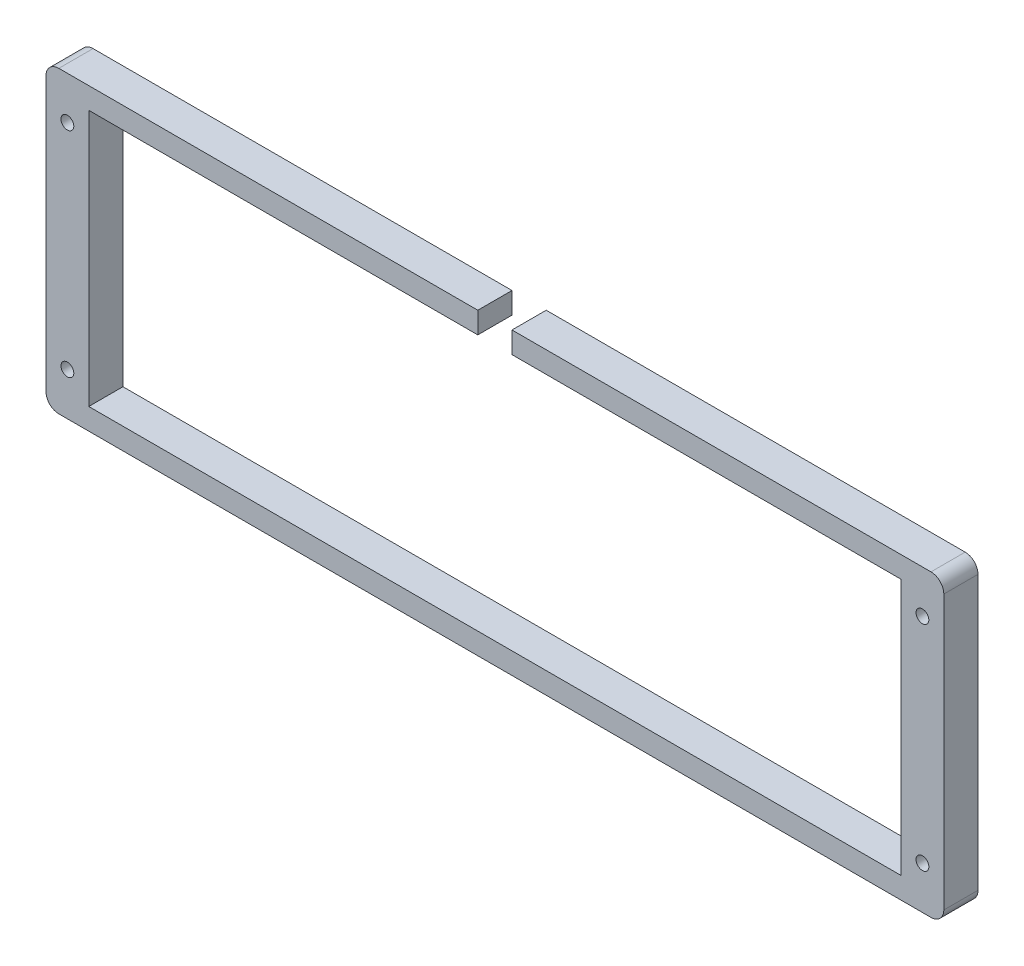
ISO-10303-21;
HEADER;
FILE_DESCRIPTION(('STEP AP214'),'2;1');
FILE_NAME('part.step','',(''),(''),'','','');
FILE_SCHEMA(('AUTOMOTIVE_DESIGN { 1 0 10303 214 1 1 1 1 }'));
ENDSEC;
DATA;
#1=APPLICATION_CONTEXT('core data for automotive mechanical design processes');
#2=APPLICATION_PROTOCOL_DEFINITION('international standard','automotive_design',2000,#1);
#3=PRODUCT_CONTEXT('',#1,'mechanical');
#4=PRODUCT('Part','Part','',(#3));
#5=PRODUCT_RELATED_PRODUCT_CATEGORY('part','',(#4));
#6=PRODUCT_DEFINITION_FORMATION('','',#4);
#7=PRODUCT_DEFINITION_CONTEXT('part definition',#1,'design');
#8=PRODUCT_DEFINITION('design','',#6,#7);
#9=PRODUCT_DEFINITION_SHAPE('','',#8);
#10=(LENGTH_UNIT() NAMED_UNIT(*) SI_UNIT(.MILLI.,.METRE.));
#11=(NAMED_UNIT(*) PLANE_ANGLE_UNIT() SI_UNIT($,.RADIAN.));
#12=(NAMED_UNIT(*) SI_UNIT($,.STERADIAN.) SOLID_ANGLE_UNIT());
#13=UNCERTAINTY_MEASURE_WITH_UNIT(LENGTH_MEASURE(1.E-05),#10,'distance_accuracy_value','');
#14=(GEOMETRIC_REPRESENTATION_CONTEXT(3) GLOBAL_UNCERTAINTY_ASSIGNED_CONTEXT((#13)) GLOBAL_UNIT_ASSIGNED_CONTEXT((#10,
#11,#12)) REPRESENTATION_CONTEXT('',''));
#15=CARTESIAN_POINT('',(0.,0.,0.));
#16=DIRECTION('',(0.,0.,1.));
#17=DIRECTION('',(1.,0.,0.));
#18=AXIS2_PLACEMENT_3D('',#15,#16,#17);
#19=CARTESIAN_POINT('',(-30.,46.5,8.));
#20=DIRECTION('',(0.,-1.,0.));
#21=DIRECTION('',(0.,0.,-1.));
#22=AXIS2_PLACEMENT_3D('',#19,#20,#21);
#23=PLANE('',#22);
#24=DIRECTION('',(-1.,0.,0.));
#25=VECTOR('',#24,1.);
#26=CARTESIAN_POINT('',(-30.,46.5,8.));
#27=LINE('',#26,#25);
#28=CARTESIAN_POINT('',(177.,46.5,8.));
#29=VERTEX_POINT('',#28);
#30=CARTESIAN_POINT('',(79.,46.5,8.));
#31=VERTEX_POINT('',#30);
#32=EDGE_CURVE('E211',#29,#31,#27,.T.);
#33=ORIENTED_EDGE('',*,*,#32,.F.);
#34=DIRECTION('',(0.,0.,-1.));
#35=VECTOR('',#34,1.);
#36=CARTESIAN_POINT('',(177.,46.5,8.));
#37=LINE('',#36,#35);
#38=CARTESIAN_POINT('',(177.,46.5,0.));
#39=VERTEX_POINT('',#38);
#40=EDGE_CURVE('E248',#29,#39,#37,.T.);
#41=ORIENTED_EDGE('',*,*,#40,.T.);
#42=DIRECTION('',(-1.,0.,0.));
#43=VECTOR('',#42,1.);
#44=CARTESIAN_POINT('',(-30.,46.5,0.));
#45=LINE('',#44,#43);
#46=CARTESIAN_POINT('',(79.,46.5,0.));
#47=VERTEX_POINT('',#46);
#48=EDGE_CURVE('E205',#39,#47,#45,.T.);
#49=ORIENTED_EDGE('',*,*,#48,.T.);
#50=DIRECTION('',(0.,0.,-1.));
#51=VECTOR('',#50,1.);
#52=CARTESIAN_POINT('',(79.,46.5,10.));
#53=LINE('',#52,#51);
#54=EDGE_CURVE('E285',#31,#47,#53,.T.);
#55=ORIENTED_EDGE('',*,*,#54,.F.);
#56=EDGE_LOOP('',(#33,#41,#49,#55));
#57=FACE_BOUND('',#56,.T.);
#58=ADVANCED_FACE('F33',(#57),#23,.F.);
#59=CARTESIAN_POINT('',(-20.,41.5,10.));
#60=DIRECTION('',(0.,-1.,0.));
#61=DIRECTION('',(0.,0.,-1.));
#62=AXIS2_PLACEMENT_3D('',#59,#60,#61);
#63=PLANE('',#62);
#64=DIRECTION('',(0.,0.,1.));
#65=VECTOR('',#64,1.);
#66=CARTESIAN_POINT('',(79.,41.5,10.));
#67=LINE('',#66,#65);
#68=CARTESIAN_POINT('',(79.,41.5,0.));
#69=VERTEX_POINT('',#68);
#70=CARTESIAN_POINT('',(79.,41.5,8.));
#71=VERTEX_POINT('',#70);
#72=EDGE_CURVE('E213',#69,#71,#67,.T.);
#73=ORIENTED_EDGE('',*,*,#72,.F.);
#74=DIRECTION('',(-1.,0.,0.));
#75=VECTOR('',#74,1.);
#76=CARTESIAN_POINT('',(-20.,41.5,0.));
#77=LINE('',#76,#75);
#78=CARTESIAN_POINT('',(170.,41.5,0.));
#79=VERTEX_POINT('',#78);
#80=EDGE_CURVE('E173',#79,#69,#77,.T.);
#81=ORIENTED_EDGE('',*,*,#80,.F.);
#82=DIRECTION('',(0.,0.,-1.));
#83=VECTOR('',#82,1.);
#84=CARTESIAN_POINT('',(170.,41.5,10.));
#85=LINE('',#84,#83);
#86=CARTESIAN_POINT('',(170.,41.5,8.));
#87=VERTEX_POINT('',#86);
#88=EDGE_CURVE('E183',#87,#79,#85,.T.);
#89=ORIENTED_EDGE('',*,*,#88,.F.);
#90=DIRECTION('',(1.,0.,0.));
#91=VECTOR('',#90,1.);
#92=CARTESIAN_POINT('',(0.,41.5,8.));
#93=LINE('',#92,#91);
#94=EDGE_CURVE('E189',#71,#87,#93,.T.);
#95=ORIENTED_EDGE('',*,*,#94,.F.);
#96=EDGE_LOOP('',(#73,#81,#89,#95));
#97=FACE_BOUND('',#96,.T.);
#98=ADVANCED_FACE('F335',(#97),#63,.T.);
#99=CARTESIAN_POINT('',(0.,0.,8.));
#100=DIRECTION('',(0.,0.,1.));
#101=DIRECTION('',(1.,0.,0.));
#102=AXIS2_PLACEMENT_3D('',#99,#100,#101);
#103=PLANE('',#102);
#104=DIRECTION('',(1.,0.,0.));
#105=VECTOR('',#104,1.);
#106=CARTESIAN_POINT('',(-30.,-23.5,8.));
#107=LINE('',#106,#105);
#108=CARTESIAN_POINT('',(-27.,-23.5,8.));
#109=VERTEX_POINT('',#108);
#110=CARTESIAN_POINT('',(177.,-23.5,8.));
#111=VERTEX_POINT('',#110);
#112=EDGE_CURVE('E204',#109,#111,#107,.T.);
#113=ORIENTED_EDGE('',*,*,#112,.T.);
#114=CARTESIAN_POINT('',(177.,-20.5,8.));
#115=DIRECTION('',(0.,0.,1.));
#116=DIRECTION('',(1.,0.,0.));
#117=AXIS2_PLACEMENT_3D('',#114,#115,#116);
#118=CIRCLE('',#117,3.);
#119=CARTESIAN_POINT('',(180.,-20.5,8.));
#120=VERTEX_POINT('',#119);
#121=EDGE_CURVE('E246',#111,#120,#118,.T.);
#122=ORIENTED_EDGE('',*,*,#121,.T.);
#123=DIRECTION('',(0.,1.,0.));
#124=VECTOR('',#123,1.);
#125=CARTESIAN_POINT('',(180.,46.5,8.));
#126=LINE('',#125,#124);
#127=CARTESIAN_POINT('',(180.,43.5,8.));
#128=VERTEX_POINT('',#127);
#129=EDGE_CURVE('E208',#120,#128,#126,.T.);
#130=ORIENTED_EDGE('',*,*,#129,.T.);
#131=CARTESIAN_POINT('',(177.,43.5,8.));
#132=DIRECTION('',(0.,0.,1.));
#133=DIRECTION('',(1.,0.,0.));
#134=AXIS2_PLACEMENT_3D('',#131,#132,#133);
#135=CIRCLE('',#134,3.);
#136=EDGE_CURVE('E48',#128,#29,#135,.T.);
#137=ORIENTED_EDGE('',*,*,#136,.T.);
#138=ORIENTED_EDGE('',*,*,#32,.T.);
#139=DIRECTION('',(0.,1.,0.));
#140=VECTOR('',#139,1.);
#141=CARTESIAN_POINT('',(79.,0.,8.));
#142=LINE('',#141,#140);
#143=EDGE_CURVE('E288',#71,#31,#142,.T.);
#144=ORIENTED_EDGE('',*,*,#143,.F.);
#145=ORIENTED_EDGE('',*,*,#94,.T.);
#146=DIRECTION('',(0.,-1.,0.));
#147=VECTOR('',#146,1.);
#148=CARTESIAN_POINT('',(170.,0.,8.));
#149=LINE('',#148,#147);
#150=CARTESIAN_POINT('',(170.,-18.5,8.));
#151=VERTEX_POINT('',#150);
#152=EDGE_CURVE('E192',#87,#151,#149,.T.);
#153=ORIENTED_EDGE('',*,*,#152,.T.);
#154=DIRECTION('',(-1.,0.,0.));
#155=VECTOR('',#154,1.);
#156=CARTESIAN_POINT('',(0.,-18.5,8.));
#157=LINE('',#156,#155);
#158=CARTESIAN_POINT('',(-20.,-18.5,8.));
#159=VERTEX_POINT('',#158);
#160=EDGE_CURVE('E195',#151,#159,#157,.T.);
#161=ORIENTED_EDGE('',*,*,#160,.T.);
#162=DIRECTION('',(0.,1.,0.));
#163=VECTOR('',#162,1.);
#164=CARTESIAN_POINT('',(-20.,0.,8.));
#165=LINE('',#164,#163);
#166=CARTESIAN_POINT('',(-20.,41.5,8.));
#167=VERTEX_POINT('',#166);
#168=EDGE_CURVE('E198',#159,#167,#165,.T.);
#169=ORIENTED_EDGE('',*,*,#168,.T.);
#170=CARTESIAN_POINT('',(71.,41.5,8.));
#171=VERTEX_POINT('',#170);
#172=EDGE_CURVE('E190',#167,#171,#93,.T.);
#173=ORIENTED_EDGE('',*,*,#172,.T.);
#174=DIRECTION('',(0.,-1.,0.));
#175=VECTOR('',#174,1.);
#176=CARTESIAN_POINT('',(71.,0.,8.));
#177=LINE('',#176,#175);
#178=CARTESIAN_POINT('',(71.,46.5,8.));
#179=VERTEX_POINT('',#178);
#180=EDGE_CURVE('E152',#179,#171,#177,.T.);
#181=ORIENTED_EDGE('',*,*,#180,.F.);
#182=CARTESIAN_POINT('',(-27.,46.5,8.));
#183=VERTEX_POINT('',#182);
#184=EDGE_CURVE('E210',#179,#183,#27,.T.);
#185=ORIENTED_EDGE('',*,*,#184,.T.);
#186=CARTESIAN_POINT('',(-27.,43.5,8.));
#187=DIRECTION('',(0.,0.,1.));
#188=DIRECTION('',(1.,0.,0.));
#189=AXIS2_PLACEMENT_3D('',#186,#187,#188);
#190=CIRCLE('',#189,3.);
#191=CARTESIAN_POINT('',(-30.,43.5,8.));
#192=VERTEX_POINT('',#191);
#193=EDGE_CURVE('E241',#183,#192,#190,.T.);
#194=ORIENTED_EDGE('',*,*,#193,.T.);
#195=DIRECTION('',(0.,-1.,0.));
#196=VECTOR('',#195,1.);
#197=CARTESIAN_POINT('',(-30.,46.5,8.));
#198=LINE('',#197,#196);
#199=CARTESIAN_POINT('',(-30.,-20.5,8.));
#200=VERTEX_POINT('',#199);
#201=EDGE_CURVE('E202',#192,#200,#198,.T.);
#202=ORIENTED_EDGE('',*,*,#201,.T.);
#203=CARTESIAN_POINT('',(-27.,-20.5,8.));
#204=DIRECTION('',(0.,0.,1.));
#205=DIRECTION('',(1.,0.,0.));
#206=AXIS2_PLACEMENT_3D('',#203,#204,#205);
#207=CIRCLE('',#206,3.);
#208=EDGE_CURVE('E243',#200,#109,#207,.T.);
#209=ORIENTED_EDGE('',*,*,#208,.T.);
#210=EDGE_LOOP('',(#113,#122,#130,#137,#138,#144,#145,#153,#161,#169,#173,#181,#185,#194,#202,#209));
#211=FACE_BOUND('',#210,.T.);
#212=CARTESIAN_POINT('',(175.,36.5,8.));
#213=DIRECTION('',(0.,0.,1.));
#214=DIRECTION('',(1.,0.,0.));
#215=AXIS2_PLACEMENT_3D('',#212,#213,#214);
#216=CIRCLE('',#215,1.5);
#217=CARTESIAN_POINT('',(176.5,36.5,8.));
#218=VERTEX_POINT('',#217);
#219=EDGE_CURVE('E312',#218,#218,#216,.F.);
#220=ORIENTED_EDGE('',*,*,#219,.T.);
#221=EDGE_LOOP('',(#220));
#222=FACE_BOUND('',#221,.T.);
#223=CARTESIAN_POINT('',(-25.,-13.5000000000001,8.));
#224=DIRECTION('',(0.,0.,1.));
#225=DIRECTION('',(1.,0.,0.));
#226=AXIS2_PLACEMENT_3D('',#223,#224,#225);
#227=CIRCLE('',#226,1.5);
#228=CARTESIAN_POINT('',(-23.5,-13.5000000000001,8.));
#229=VERTEX_POINT('',#228);
#230=EDGE_CURVE('E309',#229,#229,#227,.F.);
#231=ORIENTED_EDGE('',*,*,#230,.T.);
#232=EDGE_LOOP('',(#231));
#233=FACE_BOUND('',#232,.T.);
#234=CARTESIAN_POINT('',(175.,-13.5,8.));
#235=DIRECTION('',(0.,0.,1.));
#236=DIRECTION('',(1.,0.,0.));
#237=AXIS2_PLACEMENT_3D('',#234,#235,#236);
#238=CIRCLE('',#237,1.5);
#239=CARTESIAN_POINT('',(176.5,-13.5,8.));
#240=VERTEX_POINT('',#239);
#241=EDGE_CURVE('E304',#240,#240,#238,.F.);
#242=ORIENTED_EDGE('',*,*,#241,.T.);
#243=EDGE_LOOP('',(#242));
#244=FACE_BOUND('',#243,.T.);
#245=CARTESIAN_POINT('',(-25.,36.5,8.));
#246=DIRECTION('',(0.,0.,1.));
#247=DIRECTION('',(1.,0.,0.));
#248=AXIS2_PLACEMENT_3D('',#245,#246,#247);
#249=CIRCLE('',#248,1.5);
#250=CARTESIAN_POINT('',(-23.5,36.5,8.));
#251=VERTEX_POINT('',#250);
#252=EDGE_CURVE('E318',#251,#251,#249,.F.);
#253=ORIENTED_EDGE('',*,*,#252,.T.);
#254=EDGE_LOOP('',(#253));
#255=FACE_BOUND('',#254,.T.);
#256=ADVANCED_FACE('F268',(#211,#222,#233,#244,#255),#103,.T.);
#257=CARTESIAN_POINT('',(0.,0.,0.));
#258=DIRECTION('',(0.,0.,1.));
#259=DIRECTION('',(1.,0.,0.));
#260=AXIS2_PLACEMENT_3D('',#257,#258,#259);
#261=PLANE('',#260);
#262=CARTESIAN_POINT('',(175.,36.5,0.));
#263=DIRECTION('',(0.,0.,1.));
#264=DIRECTION('',(-1.,0.,0.));
#265=AXIS2_PLACEMENT_3D('',#262,#263,#264);
#266=CIRCLE('',#265,1.5);
#267=CARTESIAN_POINT('',(173.5,36.5,0.));
#268=VERTEX_POINT('',#267);
#269=EDGE_CURVE('E301',#268,#268,#266,.T.);
#270=ORIENTED_EDGE('',*,*,#269,.T.);
#271=EDGE_LOOP('',(#270));
#272=FACE_BOUND('',#271,.T.);
#273=CARTESIAN_POINT('',(-25.,-13.5000000000001,0.));
#274=DIRECTION('',(0.,0.,1.));
#275=DIRECTION('',(-1.,0.,0.));
#276=AXIS2_PLACEMENT_3D('',#273,#274,#275);
#277=CIRCLE('',#276,1.5);
#278=CARTESIAN_POINT('',(-26.5,-13.5000000000001,0.));
#279=VERTEX_POINT('',#278);
#280=EDGE_CURVE('E296',#279,#279,#277,.T.);
#281=ORIENTED_EDGE('',*,*,#280,.T.);
#282=EDGE_LOOP('',(#281));
#283=FACE_BOUND('',#282,.T.);
#284=CARTESIAN_POINT('',(175.,-13.5,0.));
#285=DIRECTION('',(0.,0.,1.));
#286=DIRECTION('',(1.,0.,0.));
#287=AXIS2_PLACEMENT_3D('',#284,#285,#286);
#288=CIRCLE('',#287,1.5);
#289=CARTESIAN_POINT('',(176.5,-13.5,0.));
#290=VERTEX_POINT('',#289);
#291=EDGE_CURVE('E293',#290,#290,#288,.T.);
#292=ORIENTED_EDGE('',*,*,#291,.T.);
#293=EDGE_LOOP('',(#292));
#294=FACE_BOUND('',#293,.T.);
#295=CARTESIAN_POINT('',(-25.,36.5,0.));
#296=DIRECTION('',(0.,0.,1.));
#297=DIRECTION('',(1.,0.,0.));
#298=AXIS2_PLACEMENT_3D('',#295,#296,#297);
#299=CIRCLE('',#298,1.5);
#300=CARTESIAN_POINT('',(-23.5,36.5,0.));
#301=VERTEX_POINT('',#300);
#302=EDGE_CURVE('E315',#301,#301,#299,.T.);
#303=ORIENTED_EDGE('',*,*,#302,.T.);
#304=EDGE_LOOP('',(#303));
#305=FACE_BOUND('',#304,.T.);
#306=DIRECTION('',(0.,1.,0.));
#307=VECTOR('',#306,1.);
#308=CARTESIAN_POINT('',(180.,46.5,0.));
#309=LINE('',#308,#307);
#310=CARTESIAN_POINT('',(180.,-20.5,0.));
#311=VERTEX_POINT('',#310);
#312=CARTESIAN_POINT('',(180.,43.5,0.));
#313=VERTEX_POINT('',#312);
#314=EDGE_CURVE('E218',#311,#313,#309,.T.);
#315=ORIENTED_EDGE('',*,*,#314,.F.);
#316=CARTESIAN_POINT('',(177.,-20.5,0.));
#317=DIRECTION('',(0.,0.,1.));
#318=DIRECTION('',(1.,0.,0.));
#319=AXIS2_PLACEMENT_3D('',#316,#317,#318);
#320=CIRCLE('',#319,3.);
#321=CARTESIAN_POINT('',(177.,-23.5,0.));
#322=VERTEX_POINT('',#321);
#323=EDGE_CURVE('E234',#311,#322,#320,.F.);
#324=ORIENTED_EDGE('',*,*,#323,.T.);
#325=DIRECTION('',(1.,0.,0.));
#326=VECTOR('',#325,1.);
#327=CARTESIAN_POINT('',(-30.,-23.5,0.));
#328=LINE('',#327,#326);
#329=CARTESIAN_POINT('',(-27.,-23.5,0.));
#330=VERTEX_POINT('',#329);
#331=EDGE_CURVE('E215',#330,#322,#328,.T.);
#332=ORIENTED_EDGE('',*,*,#331,.F.);
#333=CARTESIAN_POINT('',(-27.,-20.5,0.));
#334=DIRECTION('',(0.,0.,1.));
#335=DIRECTION('',(1.,0.,0.));
#336=AXIS2_PLACEMENT_3D('',#333,#334,#335);
#337=CIRCLE('',#336,3.);
#338=CARTESIAN_POINT('',(-30.,-20.5,0.));
#339=VERTEX_POINT('',#338);
#340=EDGE_CURVE('E230',#330,#339,#337,.F.);
#341=ORIENTED_EDGE('',*,*,#340,.T.);
#342=DIRECTION('',(0.,-1.,0.));
#343=VECTOR('',#342,1.);
#344=CARTESIAN_POINT('',(-30.,46.5,0.));
#345=LINE('',#344,#343);
#346=CARTESIAN_POINT('',(-30.,43.5,0.));
#347=VERTEX_POINT('',#346);
#348=EDGE_CURVE('E201',#347,#339,#345,.T.);
#349=ORIENTED_EDGE('',*,*,#348,.F.);
#350=CARTESIAN_POINT('',(-27.,43.5,0.));
#351=DIRECTION('',(0.,0.,1.));
#352=DIRECTION('',(1.,0.,0.));
#353=AXIS2_PLACEMENT_3D('',#350,#351,#352);
#354=CIRCLE('',#353,3.);
#355=CARTESIAN_POINT('',(-27.,46.5,0.));
#356=VERTEX_POINT('',#355);
#357=EDGE_CURVE('E228',#347,#356,#354,.F.);
#358=ORIENTED_EDGE('',*,*,#357,.T.);
#359=CARTESIAN_POINT('',(71.,46.5,0.));
#360=VERTEX_POINT('',#359);
#361=EDGE_CURVE('E167',#360,#356,#45,.T.);
#362=ORIENTED_EDGE('',*,*,#361,.F.);
#363=DIRECTION('',(0.,1.,0.));
#364=VECTOR('',#363,1.);
#365=CARTESIAN_POINT('',(71.,41.5,0.));
#366=LINE('',#365,#364);
#367=CARTESIAN_POINT('',(71.,41.5,0.));
#368=VERTEX_POINT('',#367);
#369=EDGE_CURVE('E149',#368,#360,#366,.T.);
#370=ORIENTED_EDGE('',*,*,#369,.F.);
#371=CARTESIAN_POINT('',(-20.,41.5,0.));
#372=VERTEX_POINT('',#371);
#373=EDGE_CURVE('E164',#368,#372,#77,.T.);
#374=ORIENTED_EDGE('',*,*,#373,.T.);
#375=DIRECTION('',(0.,-1.,0.));
#376=VECTOR('',#375,1.);
#377=CARTESIAN_POINT('',(-20.,41.5,0.));
#378=LINE('',#377,#376);
#379=CARTESIAN_POINT('',(-20.,-18.5,0.));
#380=VERTEX_POINT('',#379);
#381=EDGE_CURVE('E321',#372,#380,#378,.T.);
#382=ORIENTED_EDGE('',*,*,#381,.T.);
#383=DIRECTION('',(1.,0.,0.));
#384=VECTOR('',#383,1.);
#385=CARTESIAN_POINT('',(-20.,-18.5,0.));
#386=LINE('',#385,#384);
#387=CARTESIAN_POINT('',(170.,-18.5,0.));
#388=VERTEX_POINT('',#387);
#389=EDGE_CURVE('E178',#380,#388,#386,.T.);
#390=ORIENTED_EDGE('',*,*,#389,.T.);
#391=DIRECTION('',(0.,1.,0.));
#392=VECTOR('',#391,1.);
#393=CARTESIAN_POINT('',(170.,41.5,0.));
#394=LINE('',#393,#392);
#395=EDGE_CURVE('E174',#388,#79,#394,.T.);
#396=ORIENTED_EDGE('',*,*,#395,.T.);
#397=ORIENTED_EDGE('',*,*,#80,.T.);
#398=DIRECTION('',(0.,1.,0.));
#399=VECTOR('',#398,1.);
#400=CARTESIAN_POINT('',(79.,41.5,0.));
#401=LINE('',#400,#399);
#402=EDGE_CURVE('E156',#69,#47,#401,.T.);
#403=ORIENTED_EDGE('',*,*,#402,.T.);
#404=ORIENTED_EDGE('',*,*,#48,.F.);
#405=CARTESIAN_POINT('',(177.,43.5,0.));
#406=DIRECTION('',(0.,0.,1.));
#407=DIRECTION('',(1.,0.,0.));
#408=AXIS2_PLACEMENT_3D('',#405,#406,#407);
#409=CIRCLE('',#408,3.);
#410=EDGE_CURVE('E232',#39,#313,#409,.F.);
#411=ORIENTED_EDGE('',*,*,#410,.T.);
#412=EDGE_LOOP('',(#315,#324,#332,#341,#349,#358,#362,#370,#374,#382,#390,#396,#397,#403,#404,#411));
#413=FACE_BOUND('',#412,.T.);
#414=ADVANCED_FACE('F162',(#272,#283,#294,#305,#413),#261,.F.);
#415=CARTESIAN_POINT('',(-30.,46.5,8.));
#416=DIRECTION('',(1.,0.,0.));
#417=DIRECTION('',(0.,0.,-1.));
#418=AXIS2_PLACEMENT_3D('',#415,#416,#417);
#419=PLANE('',#418);
#420=ORIENTED_EDGE('',*,*,#348,.T.);
#421=DIRECTION('',(0.,0.,-1.));
#422=VECTOR('',#421,1.);
#423=CARTESIAN_POINT('',(-30.,-20.5,8.));
#424=LINE('',#423,#422);
#425=EDGE_CURVE('E41',#339,#200,#424,.F.);
#426=ORIENTED_EDGE('',*,*,#425,.T.);
#427=ORIENTED_EDGE('',*,*,#201,.F.);
#428=DIRECTION('',(0.,0.,-1.));
#429=VECTOR('',#428,1.);
#430=CARTESIAN_POINT('',(-30.,43.5,8.));
#431=LINE('',#430,#429);
#432=EDGE_CURVE('E251',#192,#347,#431,.T.);
#433=ORIENTED_EDGE('',*,*,#432,.T.);
#434=EDGE_LOOP('',(#420,#426,#427,#433));
#435=FACE_BOUND('',#434,.T.);
#436=ADVANCED_FACE('F255',(#435),#419,.F.);
#437=CARTESIAN_POINT('',(-30.,-23.5,8.));
#438=DIRECTION('',(0.,1.,0.));
#439=DIRECTION('',(0.,0.,1.));
#440=AXIS2_PLACEMENT_3D('',#437,#438,#439);
#441=PLANE('',#440);
#442=ORIENTED_EDGE('',*,*,#331,.T.);
#443=DIRECTION('',(0.,0.,-1.));
#444=VECTOR('',#443,1.);
#445=CARTESIAN_POINT('',(177.,-23.5,8.));
#446=LINE('',#445,#444);
#447=EDGE_CURVE('E239',#322,#111,#446,.F.);
#448=ORIENTED_EDGE('',*,*,#447,.T.);
#449=ORIENTED_EDGE('',*,*,#112,.F.);
#450=DIRECTION('',(0.,0.,-1.));
#451=VECTOR('',#450,1.);
#452=CARTESIAN_POINT('',(-27.,-23.5,8.));
#453=LINE('',#452,#451);
#454=EDGE_CURVE('E236',#109,#330,#453,.T.);
#455=ORIENTED_EDGE('',*,*,#454,.T.);
#456=EDGE_LOOP('',(#442,#448,#449,#455));
#457=FACE_BOUND('',#456,.T.);
#458=ADVANCED_FACE('F265',(#457),#441,.F.);
#459=CARTESIAN_POINT('',(180.,46.5,8.));
#460=DIRECTION('',(-1.,0.,0.));
#461=DIRECTION('',(0.,0.,1.));
#462=AXIS2_PLACEMENT_3D('',#459,#460,#461);
#463=PLANE('',#462);
#464=ORIENTED_EDGE('',*,*,#129,.F.);
#465=DIRECTION('',(0.,0.,-1.));
#466=VECTOR('',#465,1.);
#467=CARTESIAN_POINT('',(180.,-20.5,8.));
#468=LINE('',#467,#466);
#469=EDGE_CURVE('E225',#120,#311,#468,.T.);
#470=ORIENTED_EDGE('',*,*,#469,.T.);
#471=ORIENTED_EDGE('',*,*,#314,.T.);
#472=DIRECTION('',(0.,0.,-1.));
#473=VECTOR('',#472,1.);
#474=CARTESIAN_POINT('',(180.,43.5,8.));
#475=LINE('',#474,#473);
#476=EDGE_CURVE('E223',#313,#128,#475,.F.);
#477=ORIENTED_EDGE('',*,*,#476,.T.);
#478=EDGE_LOOP('',(#464,#470,#471,#477));
#479=FACE_BOUND('',#478,.T.);
#480=ADVANCED_FACE('F275',(#479),#463,.F.);
#481=ORIENTED_EDGE('',*,*,#361,.T.);
#482=DIRECTION('',(0.,0.,-1.));
#483=VECTOR('',#482,1.);
#484=CARTESIAN_POINT('',(-27.,46.5,8.));
#485=LINE('',#484,#483);
#486=EDGE_CURVE('E11',#356,#183,#485,.F.);
#487=ORIENTED_EDGE('',*,*,#486,.T.);
#488=ORIENTED_EDGE('',*,*,#184,.F.);
#489=DIRECTION('',(0.,0.,1.));
#490=VECTOR('',#489,1.);
#491=CARTESIAN_POINT('',(71.,46.5,10.));
#492=LINE('',#491,#490);
#493=EDGE_CURVE('E157',#360,#179,#492,.T.);
#494=ORIENTED_EDGE('',*,*,#493,.F.);
#495=EDGE_LOOP('',(#481,#487,#488,#494));
#496=FACE_BOUND('',#495,.T.);
#497=ADVANCED_FACE('F341',(#496),#23,.F.);
#498=CARTESIAN_POINT('',(-20.,41.5,10.));
#499=DIRECTION('',(1.,0.,0.));
#500=DIRECTION('',(0.,1.,0.));
#501=AXIS2_PLACEMENT_3D('',#498,#499,#500);
#502=PLANE('',#501);
#503=DIRECTION('',(0.,0.,-1.));
#504=VECTOR('',#503,1.);
#505=CARTESIAN_POINT('',(-20.,-18.5,10.));
#506=LINE('',#505,#504);
#507=EDGE_CURVE('E187',#159,#380,#506,.T.);
#508=ORIENTED_EDGE('',*,*,#507,.T.);
#509=ORIENTED_EDGE('',*,*,#381,.F.);
#510=DIRECTION('',(0.,0.,-1.));
#511=VECTOR('',#510,1.);
#512=CARTESIAN_POINT('',(-20.,41.5,10.));
#513=LINE('',#512,#511);
#514=EDGE_CURVE('E172',#167,#372,#513,.T.);
#515=ORIENTED_EDGE('',*,*,#514,.F.);
#516=ORIENTED_EDGE('',*,*,#168,.F.);
#517=EDGE_LOOP('',(#508,#509,#515,#516));
#518=FACE_BOUND('',#517,.T.);
#519=ADVANCED_FACE('F356',(#518),#502,.T.);
#520=CARTESIAN_POINT('',(-20.,-18.5,10.));
#521=DIRECTION('',(0.,1.,0.));
#522=DIRECTION('',(0.,0.,1.));
#523=AXIS2_PLACEMENT_3D('',#520,#521,#522);
#524=PLANE('',#523);
#525=DIRECTION('',(0.,0.,-1.));
#526=VECTOR('',#525,1.);
#527=CARTESIAN_POINT('',(170.,-18.5,10.));
#528=LINE('',#527,#526);
#529=EDGE_CURVE('E185',#151,#388,#528,.T.);
#530=ORIENTED_EDGE('',*,*,#529,.T.);
#531=ORIENTED_EDGE('',*,*,#389,.F.);
#532=ORIENTED_EDGE('',*,*,#507,.F.);
#533=ORIENTED_EDGE('',*,*,#160,.F.);
#534=EDGE_LOOP('',(#530,#531,#532,#533));
#535=FACE_BOUND('',#534,.T.);
#536=ADVANCED_FACE('F327',(#535),#524,.T.);
#537=CARTESIAN_POINT('',(170.,41.5,10.));
#538=DIRECTION('',(-1.,0.,0.));
#539=DIRECTION('',(0.,0.,1.));
#540=AXIS2_PLACEMENT_3D('',#537,#538,#539);
#541=PLANE('',#540);
#542=ORIENTED_EDGE('',*,*,#88,.T.);
#543=ORIENTED_EDGE('',*,*,#395,.F.);
#544=ORIENTED_EDGE('',*,*,#529,.F.);
#545=ORIENTED_EDGE('',*,*,#152,.F.);
#546=EDGE_LOOP('',(#542,#543,#544,#545));
#547=FACE_BOUND('',#546,.T.);
#548=ADVANCED_FACE('F331',(#547),#541,.T.);
#549=DIRECTION('',(0.,0.,1.));
#550=VECTOR('',#549,1.);
#551=CARTESIAN_POINT('',(71.,41.5,10.));
#552=LINE('',#551,#550);
#553=EDGE_CURVE('E146',#368,#171,#552,.T.);
#554=ORIENTED_EDGE('',*,*,#553,.T.);
#555=ORIENTED_EDGE('',*,*,#172,.F.);
#556=ORIENTED_EDGE('',*,*,#514,.T.);
#557=ORIENTED_EDGE('',*,*,#373,.F.);
#558=EDGE_LOOP('',(#554,#555,#556,#557));
#559=FACE_BOUND('',#558,.T.);
#560=ADVANCED_FACE('F170',(#559),#63,.T.);
#561=CARTESIAN_POINT('',(-25.,36.5,10.));
#562=DIRECTION('',(0.,0.,-1.));
#563=DIRECTION('',(-1.,0.,0.));
#564=AXIS2_PLACEMENT_3D('',#561,#562,#563);
#565=CYLINDRICAL_SURFACE('',#564,1.5);
#566=ORIENTED_EDGE('',*,*,#252,.F.);
#567=EDGE_LOOP('',(#566));
#568=FACE_BOUND('',#567,.T.);
#569=ORIENTED_EDGE('',*,*,#302,.F.);
#570=EDGE_LOOP('',(#569));
#571=FACE_BOUND('',#570,.T.);
#572=ADVANCED_FACE('F445',(#568,#571),#565,.F.);
#573=CARTESIAN_POINT('',(175.,-13.5,10.));
#574=DIRECTION('',(0.,0.,-1.));
#575=DIRECTION('',(-1.,0.,0.));
#576=AXIS2_PLACEMENT_3D('',#573,#574,#575);
#577=CYLINDRICAL_SURFACE('',#576,1.5);
#578=ORIENTED_EDGE('',*,*,#241,.F.);
#579=EDGE_LOOP('',(#578));
#580=FACE_BOUND('',#579,.T.);
#581=ORIENTED_EDGE('',*,*,#291,.F.);
#582=EDGE_LOOP('',(#581));
#583=FACE_BOUND('',#582,.T.);
#584=ADVANCED_FACE('F436',(#580,#583),#577,.F.);
#585=CARTESIAN_POINT('',(-25.,-13.5000000000001,10.));
#586=DIRECTION('',(0.,0.,-1.));
#587=DIRECTION('',(-1.,0.,0.));
#588=AXIS2_PLACEMENT_3D('',#585,#586,#587);
#589=CYLINDRICAL_SURFACE('',#588,1.5);
#590=ORIENTED_EDGE('',*,*,#230,.F.);
#591=EDGE_LOOP('',(#590));
#592=FACE_BOUND('',#591,.T.);
#593=ORIENTED_EDGE('',*,*,#280,.F.);
#594=EDGE_LOOP('',(#593));
#595=FACE_BOUND('',#594,.T.);
#596=ADVANCED_FACE('F427',(#592,#595),#589,.F.);
#597=CARTESIAN_POINT('',(175.,36.5,10.));
#598=DIRECTION('',(0.,0.,-1.));
#599=DIRECTION('',(-1.,0.,0.));
#600=AXIS2_PLACEMENT_3D('',#597,#598,#599);
#601=CYLINDRICAL_SURFACE('',#600,1.5);
#602=ORIENTED_EDGE('',*,*,#219,.F.);
#603=EDGE_LOOP('',(#602));
#604=FACE_BOUND('',#603,.T.);
#605=ORIENTED_EDGE('',*,*,#269,.F.);
#606=EDGE_LOOP('',(#605));
#607=FACE_BOUND('',#606,.T.);
#608=ADVANCED_FACE('F408',(#604,#607),#601,.F.);
#609=CARTESIAN_POINT('',(71.,41.5,10.));
#610=DIRECTION('',(-1.,0.,0.));
#611=DIRECTION('',(0.,0.,1.));
#612=AXIS2_PLACEMENT_3D('',#609,#610,#611);
#613=PLANE('',#612);
#614=ORIENTED_EDGE('',*,*,#180,.T.);
#615=ORIENTED_EDGE('',*,*,#553,.F.);
#616=ORIENTED_EDGE('',*,*,#369,.T.);
#617=ORIENTED_EDGE('',*,*,#493,.T.);
#618=EDGE_LOOP('',(#614,#615,#616,#617));
#619=FACE_BOUND('',#618,.T.);
#620=ADVANCED_FACE('F148',(#619),#613,.F.);
#621=CARTESIAN_POINT('',(79.,41.5,10.));
#622=DIRECTION('',(1.,0.,0.));
#623=DIRECTION('',(0.,0.,-1.));
#624=AXIS2_PLACEMENT_3D('',#621,#622,#623);
#625=PLANE('',#624);
#626=ORIENTED_EDGE('',*,*,#143,.T.);
#627=ORIENTED_EDGE('',*,*,#54,.T.);
#628=ORIENTED_EDGE('',*,*,#402,.F.);
#629=ORIENTED_EDGE('',*,*,#72,.T.);
#630=EDGE_LOOP('',(#626,#627,#628,#629));
#631=FACE_BOUND('',#630,.T.);
#632=ADVANCED_FACE('F291',(#631),#625,.F.);
#633=CARTESIAN_POINT('',(177.,-20.5,8.));
#634=DIRECTION('',(0.,0.,-1.));
#635=DIRECTION('',(-1.,0.,0.));
#636=AXIS2_PLACEMENT_3D('',#633,#634,#635);
#637=CYLINDRICAL_SURFACE('',#636,3.);
#638=ORIENTED_EDGE('',*,*,#121,.F.);
#639=ORIENTED_EDGE('',*,*,#447,.F.);
#640=ORIENTED_EDGE('',*,*,#323,.F.);
#641=ORIENTED_EDGE('',*,*,#469,.F.);
#642=EDGE_LOOP('',(#638,#639,#640,#641));
#643=FACE_BOUND('',#642,.T.);
#644=ADVANCED_FACE('F273',(#643),#637,.T.);
#645=CARTESIAN_POINT('',(177.,43.5,8.));
#646=DIRECTION('',(0.,0.,-1.));
#647=DIRECTION('',(-1.,0.,0.));
#648=AXIS2_PLACEMENT_3D('',#645,#646,#647);
#649=CYLINDRICAL_SURFACE('',#648,3.);
#650=ORIENTED_EDGE('',*,*,#136,.F.);
#651=ORIENTED_EDGE('',*,*,#476,.F.);
#652=ORIENTED_EDGE('',*,*,#410,.F.);
#653=ORIENTED_EDGE('',*,*,#40,.F.);
#654=EDGE_LOOP('',(#650,#651,#652,#653));
#655=FACE_BOUND('',#654,.T.);
#656=ADVANCED_FACE('F281',(#655),#649,.T.);
#657=CARTESIAN_POINT('',(-27.,-20.5,8.));
#658=DIRECTION('',(0.,0.,-1.));
#659=DIRECTION('',(-1.,0.,0.));
#660=AXIS2_PLACEMENT_3D('',#657,#658,#659);
#661=CYLINDRICAL_SURFACE('',#660,3.);
#662=ORIENTED_EDGE('',*,*,#208,.F.);
#663=ORIENTED_EDGE('',*,*,#425,.F.);
#664=ORIENTED_EDGE('',*,*,#340,.F.);
#665=ORIENTED_EDGE('',*,*,#454,.F.);
#666=EDGE_LOOP('',(#662,#663,#664,#665));
#667=FACE_BOUND('',#666,.T.);
#668=ADVANCED_FACE('F262',(#667),#661,.T.);
#669=CARTESIAN_POINT('',(-27.,43.5,8.));
#670=DIRECTION('',(0.,0.,-1.));
#671=DIRECTION('',(-1.,0.,0.));
#672=AXIS2_PLACEMENT_3D('',#669,#670,#671);
#673=CYLINDRICAL_SURFACE('',#672,3.);
#674=ORIENTED_EDGE('',*,*,#193,.F.);
#675=ORIENTED_EDGE('',*,*,#486,.F.);
#676=ORIENTED_EDGE('',*,*,#357,.F.);
#677=ORIENTED_EDGE('',*,*,#432,.F.);
#678=EDGE_LOOP('',(#674,#675,#676,#677));
#679=FACE_BOUND('',#678,.T.);
#680=ADVANCED_FACE('F35',(#679),#673,.T.);
#681=CLOSED_SHELL('',(#58,#98,#256,#414,#436,#458,#480,#497,#519,#536,#548,#560,#572,#584,#596,
#608,#620,#632,#644,#656,#668,#680));
#682=MANIFOLD_SOLID_BREP('B2',#681);
#683=ADVANCED_BREP_SHAPE_REPRESENTATION('',(#18,#682),#14);
#684=SHAPE_DEFINITION_REPRESENTATION(#9,#683);
ENDSEC;
END-ISO-10303-21;
